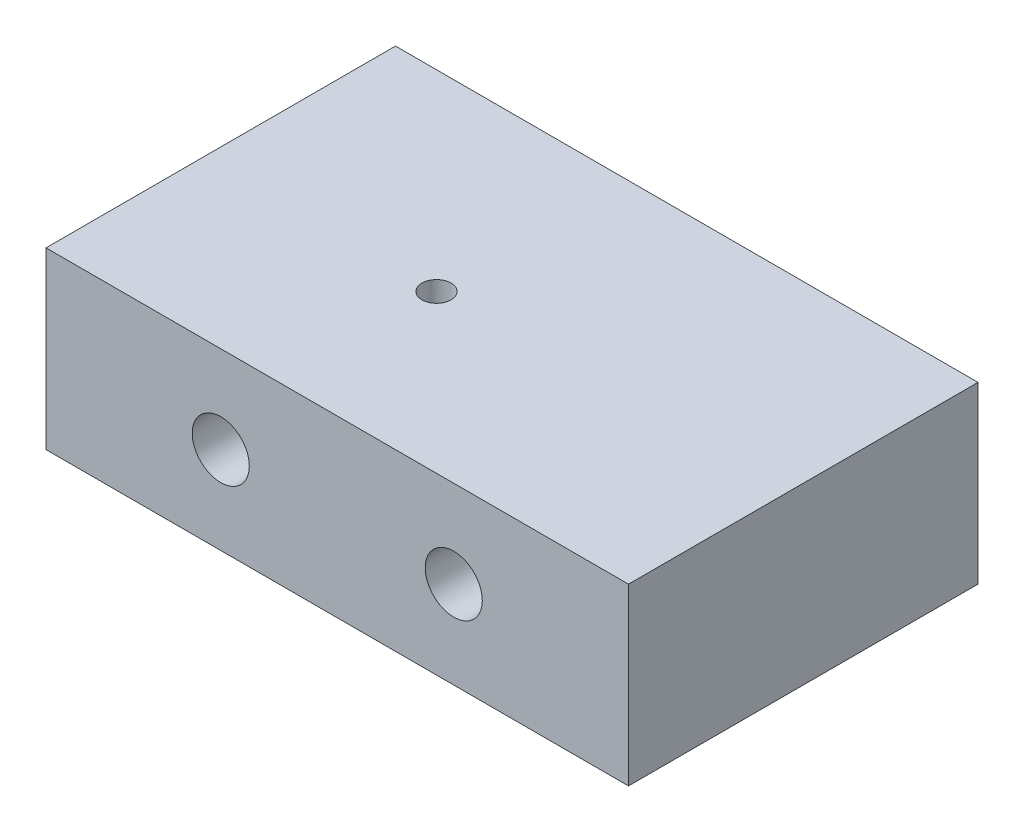
ISO-10303-21;
HEADER;
FILE_DESCRIPTION(('STEP AP214'),'2;1');
FILE_NAME('part.step','',(''),(''),'','','');
FILE_SCHEMA(('AUTOMOTIVE_DESIGN { 1 0 10303 214 1 1 1 1 }'));
ENDSEC;
DATA;
#1=APPLICATION_CONTEXT('core data for automotive mechanical design processes');
#2=APPLICATION_PROTOCOL_DEFINITION('international standard','automotive_design',2000,#1);
#3=PRODUCT_CONTEXT('',#1,'mechanical');
#4=PRODUCT('Part','Part','',(#3));
#5=PRODUCT_RELATED_PRODUCT_CATEGORY('part','',(#4));
#6=PRODUCT_DEFINITION_FORMATION('','',#4);
#7=PRODUCT_DEFINITION_CONTEXT('part definition',#1,'design');
#8=PRODUCT_DEFINITION('design','',#6,#7);
#9=PRODUCT_DEFINITION_SHAPE('','',#8);
#10=(LENGTH_UNIT() NAMED_UNIT(*) SI_UNIT(.MILLI.,.METRE.));
#11=(NAMED_UNIT(*) PLANE_ANGLE_UNIT() SI_UNIT($,.RADIAN.));
#12=(NAMED_UNIT(*) SI_UNIT($,.STERADIAN.) SOLID_ANGLE_UNIT());
#13=UNCERTAINTY_MEASURE_WITH_UNIT(LENGTH_MEASURE(1.E-05),#10,'distance_accuracy_value','');
#14=(GEOMETRIC_REPRESENTATION_CONTEXT(3) GLOBAL_UNCERTAINTY_ASSIGNED_CONTEXT((#13)) GLOBAL_UNIT_ASSIGNED_CONTEXT((#10,
#11,#12)) REPRESENTATION_CONTEXT('',''));
#15=CARTESIAN_POINT('',(0.,0.,0.));
#16=DIRECTION('',(0.,0.,1.));
#17=DIRECTION('',(1.,0.,0.));
#18=AXIS2_PLACEMENT_3D('',#15,#16,#17);
#19=CARTESIAN_POINT('',(0.,15.,0.));
#20=DIRECTION('',(1.,0.,0.));
#21=DIRECTION('',(0.,0.,-1.));
#22=AXIS2_PLACEMENT_3D('',#19,#20,#21);
#23=PLANE('',#22);
#24=DIRECTION('',(0.,0.,1.));
#25=VECTOR('',#24,1.);
#26=CARTESIAN_POINT('',(0.,0.,0.));
#27=LINE('',#26,#25);
#28=CARTESIAN_POINT('',(0.,0.,-30.));
#29=VERTEX_POINT('',#28);
#30=CARTESIAN_POINT('',(0.,0.,0.));
#31=VERTEX_POINT('',#30);
#32=EDGE_CURVE('E96',#29,#31,#27,.T.);
#33=ORIENTED_EDGE('',*,*,#32,.T.);
#34=DIRECTION('',(0.,-1.,0.));
#35=VECTOR('',#34,1.);
#36=CARTESIAN_POINT('',(0.,15.,0.));
#37=LINE('',#36,#35);
#38=CARTESIAN_POINT('',(0.,15.,0.));
#39=VERTEX_POINT('',#38);
#40=EDGE_CURVE('E11',#39,#31,#37,.T.);
#41=ORIENTED_EDGE('',*,*,#40,.F.);
#42=DIRECTION('',(0.,0.,1.));
#43=VECTOR('',#42,1.);
#44=CARTESIAN_POINT('',(0.,15.,0.));
#45=LINE('',#44,#43);
#46=CARTESIAN_POINT('',(0.,15.,-30.));
#47=VERTEX_POINT('',#46);
#48=EDGE_CURVE('E84',#47,#39,#45,.T.);
#49=ORIENTED_EDGE('',*,*,#48,.F.);
#50=DIRECTION('',(0.,-1.,0.));
#51=VECTOR('',#50,1.);
#52=CARTESIAN_POINT('',(0.,15.,-30.));
#53=LINE('',#52,#51);
#54=EDGE_CURVE('E92',#47,#29,#53,.T.);
#55=ORIENTED_EDGE('',*,*,#54,.T.);
#56=EDGE_LOOP('',(#33,#41,#49,#55));
#57=FACE_BOUND('',#56,.T.);
#58=ADVANCED_FACE('F33',(#57),#23,.F.);
#59=CARTESIAN_POINT('',(0.,15.,0.));
#60=DIRECTION('',(0.,0.,-1.));
#61=DIRECTION('',(-1.,0.,0.));
#62=AXIS2_PLACEMENT_3D('',#59,#60,#61);
#63=PLANE('',#62);
#64=CARTESIAN_POINT('',(15.,7.5,0.));
#65=DIRECTION('',(0.,0.,1.));
#66=DIRECTION('',(1.,0.,0.));
#67=AXIS2_PLACEMENT_3D('',#64,#65,#66);
#68=CIRCLE('',#67,2.45);
#69=CARTESIAN_POINT('',(17.45,7.5,0.));
#70=VERTEX_POINT('',#69);
#71=EDGE_CURVE('E116',#70,#70,#68,.T.);
#72=ORIENTED_EDGE('',*,*,#71,.F.);
#73=EDGE_LOOP('',(#72));
#74=FACE_BOUND('',#73,.T.);
#75=CARTESIAN_POINT('',(35.,7.5,0.));
#76=DIRECTION('',(0.,0.,1.));
#77=DIRECTION('',(1.,0.,0.));
#78=AXIS2_PLACEMENT_3D('',#75,#76,#77);
#79=CIRCLE('',#78,2.45);
#80=CARTESIAN_POINT('',(37.45,7.5,0.));
#81=VERTEX_POINT('',#80);
#82=EDGE_CURVE('E110',#81,#81,#79,.T.);
#83=ORIENTED_EDGE('',*,*,#82,.F.);
#84=EDGE_LOOP('',(#83));
#85=FACE_BOUND('',#84,.T.);
#86=DIRECTION('',(1.,0.,0.));
#87=VECTOR('',#86,1.);
#88=CARTESIAN_POINT('',(0.,0.,0.));
#89=LINE('',#88,#87);
#90=CARTESIAN_POINT('',(50.,0.,0.));
#91=VERTEX_POINT('',#90);
#92=EDGE_CURVE('E88',#31,#91,#89,.T.);
#93=ORIENTED_EDGE('',*,*,#92,.T.);
#94=DIRECTION('',(0.,-1.,0.));
#95=VECTOR('',#94,1.);
#96=CARTESIAN_POINT('',(50.,15.,0.));
#97=LINE('',#96,#95);
#98=CARTESIAN_POINT('',(50.,15.,0.));
#99=VERTEX_POINT('',#98);
#100=EDGE_CURVE('E41',#99,#91,#97,.T.);
#101=ORIENTED_EDGE('',*,*,#100,.F.);
#102=DIRECTION('',(1.,0.,0.));
#103=VECTOR('',#102,1.);
#104=CARTESIAN_POINT('',(0.,15.,0.));
#105=LINE('',#104,#103);
#106=EDGE_CURVE('E79',#39,#99,#105,.T.);
#107=ORIENTED_EDGE('',*,*,#106,.F.);
#108=ORIENTED_EDGE('',*,*,#40,.T.);
#109=EDGE_LOOP('',(#93,#101,#107,#108));
#110=FACE_BOUND('',#109,.T.);
#111=ADVANCED_FACE('F87',(#74,#85,#110),#63,.F.);
#112=CARTESIAN_POINT('',(50.,15.,0.));
#113=DIRECTION('',(-1.,0.,0.));
#114=DIRECTION('',(0.,0.,1.));
#115=AXIS2_PLACEMENT_3D('',#112,#113,#114);
#116=PLANE('',#115);
#117=DIRECTION('',(0.,0.,-1.));
#118=VECTOR('',#117,1.);
#119=CARTESIAN_POINT('',(50.,0.,0.));
#120=LINE('',#119,#118);
#121=CARTESIAN_POINT('',(50.,0.,-30.));
#122=VERTEX_POINT('',#121);
#123=EDGE_CURVE('E66',#91,#122,#120,.T.);
#124=ORIENTED_EDGE('',*,*,#123,.T.);
#125=DIRECTION('',(0.,-1.,0.));
#126=VECTOR('',#125,1.);
#127=CARTESIAN_POINT('',(50.,15.,-30.));
#128=LINE('',#127,#126);
#129=CARTESIAN_POINT('',(50.,15.,-30.));
#130=VERTEX_POINT('',#129);
#131=EDGE_CURVE('E89',#130,#122,#128,.T.);
#132=ORIENTED_EDGE('',*,*,#131,.F.);
#133=DIRECTION('',(0.,0.,-1.));
#134=VECTOR('',#133,1.);
#135=CARTESIAN_POINT('',(50.,15.,0.));
#136=LINE('',#135,#134);
#137=EDGE_CURVE('E82',#99,#130,#136,.T.);
#138=ORIENTED_EDGE('',*,*,#137,.F.);
#139=ORIENTED_EDGE('',*,*,#100,.T.);
#140=EDGE_LOOP('',(#124,#132,#138,#139));
#141=FACE_BOUND('',#140,.T.);
#142=ADVANCED_FACE('F90',(#141),#116,.F.);
#143=CARTESIAN_POINT('',(0.,15.,-30.));
#144=DIRECTION('',(0.,0.,1.));
#145=DIRECTION('',(1.,0.,0.));
#146=AXIS2_PLACEMENT_3D('',#143,#144,#145);
#147=PLANE('',#146);
#148=CARTESIAN_POINT('',(15.,7.5,-30.));
#149=DIRECTION('',(0.,0.,1.));
#150=DIRECTION('',(1.,0.,0.));
#151=AXIS2_PLACEMENT_3D('',#148,#149,#150);
#152=CIRCLE('',#151,2.45);
#153=CARTESIAN_POINT('',(17.45,7.5,-30.));
#154=VERTEX_POINT('',#153);
#155=EDGE_CURVE('E113',#154,#154,#152,.T.);
#156=ORIENTED_EDGE('',*,*,#155,.T.);
#157=EDGE_LOOP('',(#156));
#158=FACE_BOUND('',#157,.T.);
#159=CARTESIAN_POINT('',(35.,7.5,-30.));
#160=DIRECTION('',(0.,0.,1.));
#161=DIRECTION('',(1.,0.,0.));
#162=AXIS2_PLACEMENT_3D('',#159,#160,#161);
#163=CIRCLE('',#162,2.45);
#164=CARTESIAN_POINT('',(37.45,7.5,-30.));
#165=VERTEX_POINT('',#164);
#166=EDGE_CURVE('E99',#165,#165,#163,.T.);
#167=ORIENTED_EDGE('',*,*,#166,.T.);
#168=EDGE_LOOP('',(#167));
#169=FACE_BOUND('',#168,.T.);
#170=DIRECTION('',(-1.,0.,0.));
#171=VECTOR('',#170,1.);
#172=CARTESIAN_POINT('',(0.,0.,-30.));
#173=LINE('',#172,#171);
#174=EDGE_CURVE('E72',#122,#29,#173,.T.);
#175=ORIENTED_EDGE('',*,*,#174,.T.);
#176=ORIENTED_EDGE('',*,*,#54,.F.);
#177=DIRECTION('',(-1.,0.,0.));
#178=VECTOR('',#177,1.);
#179=CARTESIAN_POINT('',(0.,15.,-30.));
#180=LINE('',#179,#178);
#181=EDGE_CURVE('E49',#130,#47,#180,.T.);
#182=ORIENTED_EDGE('',*,*,#181,.F.);
#183=ORIENTED_EDGE('',*,*,#131,.T.);
#184=EDGE_LOOP('',(#175,#176,#182,#183));
#185=FACE_BOUND('',#184,.T.);
#186=ADVANCED_FACE('F104',(#158,#169,#185),#147,.F.);
#187=CARTESIAN_POINT('',(0.,15.,0.));
#188=DIRECTION('',(0.,-1.,0.));
#189=DIRECTION('',(0.,0.,-1.));
#190=AXIS2_PLACEMENT_3D('',#187,#188,#189);
#191=PLANE('',#190);
#192=CARTESIAN_POINT('',(20.,15.,-13.5189939421423));
#193=DIRECTION('',(0.,1.,0.));
#194=DIRECTION('',(0.,0.,1.));
#195=AXIS2_PLACEMENT_3D('',#192,#193,#194);
#196=CIRCLE('',#195,1.25);
#197=CARTESIAN_POINT('',(20.,15.,-12.2689939421423));
#198=VERTEX_POINT('',#197);
#199=EDGE_CURVE('E122',#198,#198,#196,.T.);
#200=ORIENTED_EDGE('',*,*,#199,.F.);
#201=EDGE_LOOP('',(#200));
#202=FACE_BOUND('',#201,.T.);
#203=ORIENTED_EDGE('',*,*,#48,.T.);
#204=ORIENTED_EDGE('',*,*,#106,.T.);
#205=ORIENTED_EDGE('',*,*,#137,.T.);
#206=ORIENTED_EDGE('',*,*,#181,.T.);
#207=EDGE_LOOP('',(#203,#204,#205,#206));
#208=FACE_BOUND('',#207,.T.);
#209=ADVANCED_FACE('F80',(#202,#208),#191,.F.);
#210=CARTESIAN_POINT('',(0.,0.,0.));
#211=DIRECTION('',(0.,-1.,0.));
#212=DIRECTION('',(0.,0.,-1.));
#213=AXIS2_PLACEMENT_3D('',#210,#211,#212);
#214=PLANE('',#213);
#215=CARTESIAN_POINT('',(20.,0.,-13.5189939421423));
#216=DIRECTION('',(0.,1.,0.));
#217=DIRECTION('',(0.,0.,1.));
#218=AXIS2_PLACEMENT_3D('',#215,#216,#217);
#219=CIRCLE('',#218,1.25);
#220=CARTESIAN_POINT('',(20.,0.,-12.2689939421423));
#221=VERTEX_POINT('',#220);
#222=EDGE_CURVE('E119',#221,#221,#219,.T.);
#223=ORIENTED_EDGE('',*,*,#222,.T.);
#224=EDGE_LOOP('',(#223));
#225=FACE_BOUND('',#224,.T.);
#226=ORIENTED_EDGE('',*,*,#32,.F.);
#227=ORIENTED_EDGE('',*,*,#174,.F.);
#228=ORIENTED_EDGE('',*,*,#123,.F.);
#229=ORIENTED_EDGE('',*,*,#92,.F.);
#230=EDGE_LOOP('',(#226,#227,#228,#229));
#231=FACE_BOUND('',#230,.T.);
#232=ADVANCED_FACE('F107',(#225,#231),#214,.T.);
#233=CARTESIAN_POINT('',(35.,7.5,-30.));
#234=DIRECTION('',(0.,0.,1.));
#235=DIRECTION('',(1.,0.,0.));
#236=AXIS2_PLACEMENT_3D('',#233,#234,#235);
#237=CYLINDRICAL_SURFACE('',#236,2.45);
#238=ORIENTED_EDGE('',*,*,#166,.F.);
#239=EDGE_LOOP('',(#238));
#240=FACE_BOUND('',#239,.T.);
#241=ORIENTED_EDGE('',*,*,#82,.T.);
#242=EDGE_LOOP('',(#241));
#243=FACE_BOUND('',#242,.T.);
#244=ADVANCED_FACE('F142',(#240,#243),#237,.F.);
#245=CARTESIAN_POINT('',(15.,7.5,-30.));
#246=DIRECTION('',(0.,0.,1.));
#247=DIRECTION('',(1.,0.,0.));
#248=AXIS2_PLACEMENT_3D('',#245,#246,#247);
#249=CYLINDRICAL_SURFACE('',#248,2.45);
#250=ORIENTED_EDGE('',*,*,#155,.F.);
#251=EDGE_LOOP('',(#250));
#252=FACE_BOUND('',#251,.T.);
#253=ORIENTED_EDGE('',*,*,#71,.T.);
#254=EDGE_LOOP('',(#253));
#255=FACE_BOUND('',#254,.T.);
#256=ADVANCED_FACE('F132',(#252,#255),#249,.F.);
#257=CARTESIAN_POINT('',(20.,0.,-13.5189939421423));
#258=DIRECTION('',(0.,1.,0.));
#259=DIRECTION('',(0.,0.,1.));
#260=AXIS2_PLACEMENT_3D('',#257,#258,#259);
#261=CYLINDRICAL_SURFACE('',#260,1.25);
#262=ORIENTED_EDGE('',*,*,#222,.F.);
#263=EDGE_LOOP('',(#262));
#264=FACE_BOUND('',#263,.T.);
#265=ORIENTED_EDGE('',*,*,#199,.T.);
#266=EDGE_LOOP('',(#265));
#267=FACE_BOUND('',#266,.T.);
#268=ADVANCED_FACE('F129',(#264,#267),#261,.F.);
#269=CLOSED_SHELL('',(#58,#111,#142,#186,#209,#232,#244,#256,#268));
#270=MANIFOLD_SOLID_BREP('B2',#269);
#271=ADVANCED_BREP_SHAPE_REPRESENTATION('',(#18,#270),#14);
#272=SHAPE_DEFINITION_REPRESENTATION(#9,#271);
ENDSEC;
END-ISO-10303-21;
